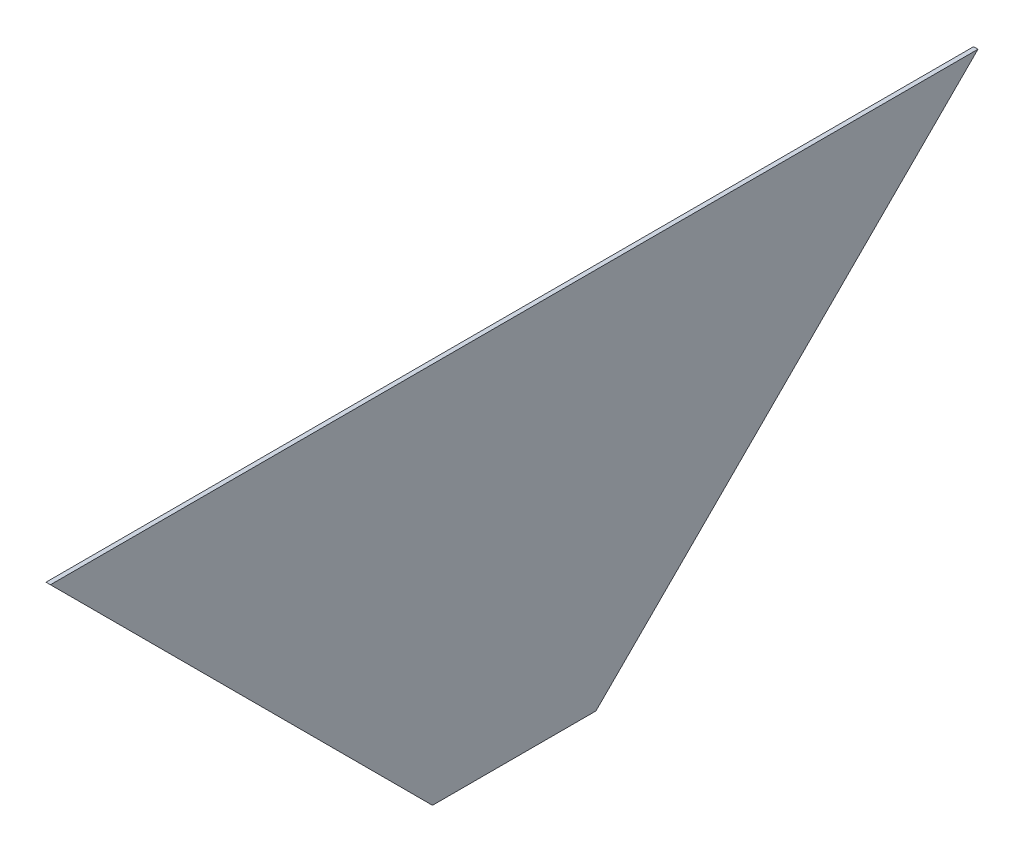
ISO-10303-21;
HEADER;
FILE_DESCRIPTION(('STEP AP214'),'2;1');
FILE_NAME('part.step','',(''),(''),'','','');
FILE_SCHEMA(('AUTOMOTIVE_DESIGN { 1 0 10303 214 1 1 1 1 }'));
ENDSEC;
DATA;
#1=APPLICATION_CONTEXT('core data for automotive mechanical design processes');
#2=APPLICATION_PROTOCOL_DEFINITION('international standard','automotive_design',2000,#1);
#3=PRODUCT_CONTEXT('',#1,'mechanical');
#4=PRODUCT('Part','Part','',(#3));
#5=PRODUCT_RELATED_PRODUCT_CATEGORY('part','',(#4));
#6=PRODUCT_DEFINITION_FORMATION('','',#4);
#7=PRODUCT_DEFINITION_CONTEXT('part definition',#1,'design');
#8=PRODUCT_DEFINITION('design','',#6,#7);
#9=PRODUCT_DEFINITION_SHAPE('','',#8);
#10=(LENGTH_UNIT() NAMED_UNIT(*) SI_UNIT(.MILLI.,.METRE.));
#11=(NAMED_UNIT(*) PLANE_ANGLE_UNIT() SI_UNIT($,.RADIAN.));
#12=(NAMED_UNIT(*) SI_UNIT($,.STERADIAN.) SOLID_ANGLE_UNIT());
#13=UNCERTAINTY_MEASURE_WITH_UNIT(LENGTH_MEASURE(1.E-05),#10,'distance_accuracy_value','');
#14=(GEOMETRIC_REPRESENTATION_CONTEXT(3) GLOBAL_UNCERTAINTY_ASSIGNED_CONTEXT((#13)) GLOBAL_UNIT_ASSIGNED_CONTEXT((#10,
#11,#12)) REPRESENTATION_CONTEXT('',''));
#15=CARTESIAN_POINT('',(0.,0.,0.));
#16=DIRECTION('',(0.,0.,1.));
#17=DIRECTION('',(1.,0.,0.));
#18=AXIS2_PLACEMENT_3D('',#15,#16,#17);
#19=CARTESIAN_POINT('',(1.50000000000004,434.000000000001,-210.));
#20=DIRECTION('',(0.,-0.707106781186546,-0.707106781186549));
#21=DIRECTION('',(0.,0.707106781186549,-0.707106781186546));
#22=AXIS2_PLACEMENT_3D('',#19,#20,#21);
#23=PLANE('',#22);
#24=DIRECTION('',(0.,0.707106781186549,-0.707106781186546));
#25=VECTOR('',#24,1.);
#26=CARTESIAN_POINT('',(3.50000000000004,434.000000000001,-210.));
#27=LINE('',#26,#25);
#28=CARTESIAN_POINT('',(3.50000000000001,261.,-37.));
#29=VERTEX_POINT('',#28);
#30=CARTESIAN_POINT('',(3.50000000000004,434.000000000001,-210.));
#31=VERTEX_POINT('',#30);
#32=EDGE_CURVE('E100',#29,#31,#27,.T.);
#33=ORIENTED_EDGE('',*,*,#32,.F.);
#34=DIRECTION('',(1.,0.,0.));
#35=VECTOR('',#34,1.);
#36=CARTESIAN_POINT('',(1.50000000000001,261.,-37.));
#37=LINE('',#36,#35);
#38=CARTESIAN_POINT('',(1.50000000000001,261.,-37.));
#39=VERTEX_POINT('',#38);
#40=EDGE_CURVE('E11',#39,#29,#37,.T.);
#41=ORIENTED_EDGE('',*,*,#40,.F.);
#42=DIRECTION('',(0.,0.707106781186549,-0.707106781186546));
#43=VECTOR('',#42,1.);
#44=CARTESIAN_POINT('',(1.50000000000004,434.000000000001,-210.));
#45=LINE('',#44,#43);
#46=CARTESIAN_POINT('',(1.50000000000004,434.000000000001,-210.));
#47=VERTEX_POINT('',#46);
#48=EDGE_CURVE('E94',#39,#47,#45,.T.);
#49=ORIENTED_EDGE('',*,*,#48,.T.);
#50=DIRECTION('',(1.,0.,0.));
#51=VECTOR('',#50,1.);
#52=CARTESIAN_POINT('',(1.50000000000004,434.000000000001,-210.));
#53=LINE('',#52,#51);
#54=EDGE_CURVE('E39',#47,#31,#53,.T.);
#55=ORIENTED_EDGE('',*,*,#54,.T.);
#56=EDGE_LOOP('',(#33,#41,#49,#55));
#57=FACE_BOUND('',#56,.T.);
#58=ADVANCED_FACE('F36',(#57),#23,.T.);
#59=CARTESIAN_POINT('',(1.49999999999999,261.,37.));
#60=DIRECTION('',(0.,-1.,0.));
#61=DIRECTION('',(0.,0.,-1.));
#62=AXIS2_PLACEMENT_3D('',#59,#60,#61);
#63=PLANE('',#62);
#64=DIRECTION('',(0.,0.,-1.));
#65=VECTOR('',#64,1.);
#66=CARTESIAN_POINT('',(3.49999999999999,261.,37.));
#67=LINE('',#66,#65);
#68=CARTESIAN_POINT('',(3.49999999999999,261.,37.));
#69=VERTEX_POINT('',#68);
#70=EDGE_CURVE('E96',#69,#29,#67,.T.);
#71=ORIENTED_EDGE('',*,*,#70,.F.);
#72=DIRECTION('',(1.,0.,0.));
#73=VECTOR('',#72,1.);
#74=CARTESIAN_POINT('',(1.49999999999999,261.,37.));
#75=LINE('',#74,#73);
#76=CARTESIAN_POINT('',(1.49999999999999,261.,37.));
#77=VERTEX_POINT('',#76);
#78=EDGE_CURVE('E45',#77,#69,#75,.T.);
#79=ORIENTED_EDGE('',*,*,#78,.F.);
#80=DIRECTION('',(0.,0.,-1.));
#81=VECTOR('',#80,1.);
#82=CARTESIAN_POINT('',(1.49999999999999,261.,37.));
#83=LINE('',#82,#81);
#84=EDGE_CURVE('E91',#77,#39,#83,.T.);
#85=ORIENTED_EDGE('',*,*,#84,.T.);
#86=ORIENTED_EDGE('',*,*,#40,.T.);
#87=EDGE_LOOP('',(#71,#79,#85,#86));
#88=FACE_BOUND('',#87,.T.);
#89=ADVANCED_FACE('F110',(#88),#63,.T.);
#90=CARTESIAN_POINT('',(1.49999999999996,434.000000000001,210.));
#91=DIRECTION('',(0.,-0.707106781186546,0.707106781186549));
#92=DIRECTION('',(0.,-0.707106781186549,-0.707106781186546));
#93=AXIS2_PLACEMENT_3D('',#90,#91,#92);
#94=PLANE('',#93);
#95=DIRECTION('',(0.,-0.707106781186549,-0.707106781186546));
#96=VECTOR('',#95,1.);
#97=CARTESIAN_POINT('',(3.49999999999996,434.000000000001,210.));
#98=LINE('',#97,#96);
#99=CARTESIAN_POINT('',(3.49999999999996,434.000000000001,210.));
#100=VERTEX_POINT('',#99);
#101=EDGE_CURVE('E86',#100,#69,#98,.T.);
#102=ORIENTED_EDGE('',*,*,#101,.F.);
#103=DIRECTION('',(1.,0.,0.));
#104=VECTOR('',#103,1.);
#105=CARTESIAN_POINT('',(1.49999999999996,434.000000000001,210.));
#106=LINE('',#105,#104);
#107=CARTESIAN_POINT('',(1.49999999999996,434.000000000001,210.));
#108=VERTEX_POINT('',#107);
#109=EDGE_CURVE('E81',#108,#100,#106,.T.);
#110=ORIENTED_EDGE('',*,*,#109,.F.);
#111=DIRECTION('',(0.,-0.707106781186549,-0.707106781186546));
#112=VECTOR('',#111,1.);
#113=CARTESIAN_POINT('',(1.49999999999996,434.000000000001,210.));
#114=LINE('',#113,#112);
#115=EDGE_CURVE('E84',#108,#77,#114,.T.);
#116=ORIENTED_EDGE('',*,*,#115,.T.);
#117=ORIENTED_EDGE('',*,*,#78,.T.);
#118=EDGE_LOOP('',(#102,#110,#116,#117));
#119=FACE_BOUND('',#118,.T.);
#120=ADVANCED_FACE('F83',(#119),#94,.T.);
#121=CARTESIAN_POINT('',(1.49999999999996,434.000000000001,210.));
#122=DIRECTION('',(0.,1.,0.));
#123=DIRECTION('',(0.,0.,1.));
#124=AXIS2_PLACEMENT_3D('',#121,#122,#123);
#125=PLANE('',#124);
#126=DIRECTION('',(0.,0.,1.));
#127=VECTOR('',#126,1.);
#128=CARTESIAN_POINT('',(3.49999999999996,434.000000000001,210.));
#129=LINE('',#128,#127);
#130=EDGE_CURVE('E103',#31,#100,#129,.T.);
#131=ORIENTED_EDGE('',*,*,#130,.F.);
#132=ORIENTED_EDGE('',*,*,#54,.F.);
#133=DIRECTION('',(0.,0.,1.));
#134=VECTOR('',#133,1.);
#135=CARTESIAN_POINT('',(1.49999999999996,434.000000000001,210.));
#136=LINE('',#135,#134);
#137=EDGE_CURVE('E90',#47,#108,#136,.T.);
#138=ORIENTED_EDGE('',*,*,#137,.T.);
#139=ORIENTED_EDGE('',*,*,#109,.T.);
#140=EDGE_LOOP('',(#131,#132,#138,#139));
#141=FACE_BOUND('',#140,.T.);
#142=ADVANCED_FACE('F93',(#141),#125,.T.);
#143=CARTESIAN_POINT('',(1.5,0.,0.));
#144=DIRECTION('',(1.,0.,0.));
#145=DIRECTION('',(0.,0.,-1.));
#146=AXIS2_PLACEMENT_3D('',#143,#144,#145);
#147=PLANE('',#146);
#148=ORIENTED_EDGE('',*,*,#48,.F.);
#149=ORIENTED_EDGE('',*,*,#84,.F.);
#150=ORIENTED_EDGE('',*,*,#115,.F.);
#151=ORIENTED_EDGE('',*,*,#137,.F.);
#152=EDGE_LOOP('',(#148,#149,#150,#151));
#153=FACE_BOUND('',#152,.T.);
#154=ADVANCED_FACE('F89',(#153),#147,.F.);
#155=CARTESIAN_POINT('',(3.5,0.,0.));
#156=DIRECTION('',(1.,0.,0.));
#157=DIRECTION('',(0.,0.,-1.));
#158=AXIS2_PLACEMENT_3D('',#155,#156,#157);
#159=PLANE('',#158);
#160=ORIENTED_EDGE('',*,*,#32,.T.);
#161=ORIENTED_EDGE('',*,*,#130,.T.);
#162=ORIENTED_EDGE('',*,*,#101,.T.);
#163=ORIENTED_EDGE('',*,*,#70,.T.);
#164=EDGE_LOOP('',(#160,#161,#162,#163));
#165=FACE_BOUND('',#164,.T.);
#166=ADVANCED_FACE('F109',(#165),#159,.T.);
#167=CLOSED_SHELL('',(#58,#89,#120,#142,#154,#166));
#168=MANIFOLD_SOLID_BREP('B2',#167);
#169=ADVANCED_BREP_SHAPE_REPRESENTATION('',(#18,#168),#14);
#170=SHAPE_DEFINITION_REPRESENTATION(#9,#169);
ENDSEC;
END-ISO-10303-21;
